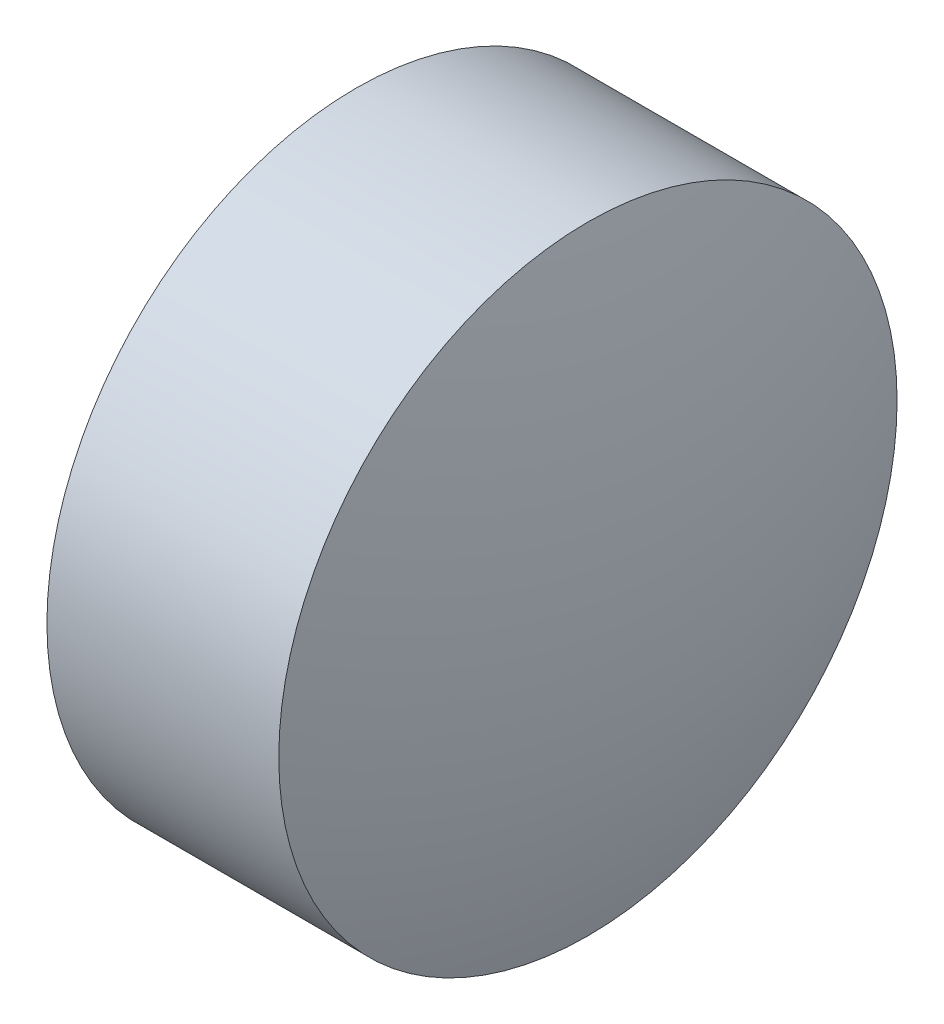
ISO-10303-21;
HEADER;
FILE_DESCRIPTION(('STEP AP214'),'2;1');
FILE_NAME('part.step','',(''),(''),'','','');
FILE_SCHEMA(('AUTOMOTIVE_DESIGN { 1 0 10303 214 1 1 1 1 }'));
ENDSEC;
DATA;
#1=APPLICATION_CONTEXT('core data for automotive mechanical design processes');
#2=APPLICATION_PROTOCOL_DEFINITION('international standard','automotive_design',2000,#1);
#3=PRODUCT_CONTEXT('',#1,'mechanical');
#4=PRODUCT('Part','Part','',(#3));
#5=PRODUCT_RELATED_PRODUCT_CATEGORY('part','',(#4));
#6=PRODUCT_DEFINITION_FORMATION('','',#4);
#7=PRODUCT_DEFINITION_CONTEXT('part definition',#1,'design');
#8=PRODUCT_DEFINITION('design','',#6,#7);
#9=PRODUCT_DEFINITION_SHAPE('','',#8);
#10=(LENGTH_UNIT() NAMED_UNIT(*) SI_UNIT(.MILLI.,.METRE.));
#11=(NAMED_UNIT(*) PLANE_ANGLE_UNIT() SI_UNIT($,.RADIAN.));
#12=(NAMED_UNIT(*) SI_UNIT($,.STERADIAN.) SOLID_ANGLE_UNIT());
#13=UNCERTAINTY_MEASURE_WITH_UNIT(LENGTH_MEASURE(1.E-05),#10,'distance_accuracy_value','');
#14=(GEOMETRIC_REPRESENTATION_CONTEXT(3) GLOBAL_UNCERTAINTY_ASSIGNED_CONTEXT((#13)) GLOBAL_UNIT_ASSIGNED_CONTEXT((#10,
#11,#12)) REPRESENTATION_CONTEXT('',''));
#15=CARTESIAN_POINT('',(0.,0.,0.));
#16=DIRECTION('',(0.,0.,1.));
#17=DIRECTION('',(1.,0.,0.));
#18=AXIS2_PLACEMENT_3D('',#15,#16,#17);
#19=CARTESIAN_POINT('',(377.950039865306,60.2048632373512,0.));
#20=DIRECTION('',(-1.,0.,0.));
#21=DIRECTION('',(0.,1.,0.));
#22=AXIS2_PLACEMENT_3D('',#19,#20,#21);
#23=SPHERICAL_SURFACE('',#22,6.81666666666668);
#24=CARTESIAN_POINT('',(384.466706531973,60.2048632373512,0.));
#25=DIRECTION('',(-1.,0.,0.));
#26=DIRECTION('',(0.,0.,1.));
#27=AXIS2_PLACEMENT_3D('',#24,#25,#26);
#28=CIRCLE('',#27,2.);
#29=CARTESIAN_POINT('',(384.466706531973,60.2048632373512,2.));
#30=VERTEX_POINT('',#29);
#31=EDGE_CURVE('E10',#30,#30,#28,.T.);
#32=ORIENTED_EDGE('',*,*,#31,.F.);
#33=EDGE_LOOP('',(#32));
#34=FACE_BOUND('',#33,.T.);
#35=ADVANCED_FACE('F35',(#34),#23,.T.);
#36=CARTESIAN_POINT('',(382.538599837926,60.2048632373512,0.));
#37=DIRECTION('',(-1.,0.,0.));
#38=DIRECTION('',(0.,0.,1.));
#39=AXIS2_PLACEMENT_3D('',#36,#37,#38);
#40=CYLINDRICAL_SURFACE('',#39,2.);
#41=CARTESIAN_POINT('',(382.966706531973,60.2048632373512,0.));
#42=DIRECTION('',(-1.,0.,0.));
#43=DIRECTION('',(0.,0.,1.));
#44=AXIS2_PLACEMENT_3D('',#41,#42,#43);
#45=CIRCLE('',#44,2.);
#46=CARTESIAN_POINT('',(382.966706531973,60.2048632373512,2.));
#47=VERTEX_POINT('',#46);
#48=EDGE_CURVE('E41',#47,#47,#45,.T.);
#49=ORIENTED_EDGE('',*,*,#48,.F.);
#50=EDGE_LOOP('',(#49));
#51=FACE_BOUND('',#50,.T.);
#52=ORIENTED_EDGE('',*,*,#31,.T.);
#53=EDGE_LOOP('',(#52));
#54=FACE_BOUND('',#53,.T.);
#55=ADVANCED_FACE('F49',(#51,#54),#40,.T.);
#56=CARTESIAN_POINT('',(382.966706531973,60.2048632373512,0.));
#57=DIRECTION('',(1.,0.,0.));
#58=DIRECTION('',(0.,0.,-1.));
#59=AXIS2_PLACEMENT_3D('',#56,#57,#58);
#60=PLANE('',#59);
#61=ORIENTED_EDGE('',*,*,#48,.T.);
#62=EDGE_LOOP('',(#61));
#63=FACE_BOUND('',#62,.T.);
#64=ADVANCED_FACE('F47',(#63),#60,.F.);
#65=CLOSED_SHELL('',(#35,#55,#64));
#66=MANIFOLD_SOLID_BREP('B2',#65);
#67=ADVANCED_BREP_SHAPE_REPRESENTATION('',(#18,#66),#14);
#68=SHAPE_DEFINITION_REPRESENTATION(#9,#67);
ENDSEC;
END-ISO-10303-21;
